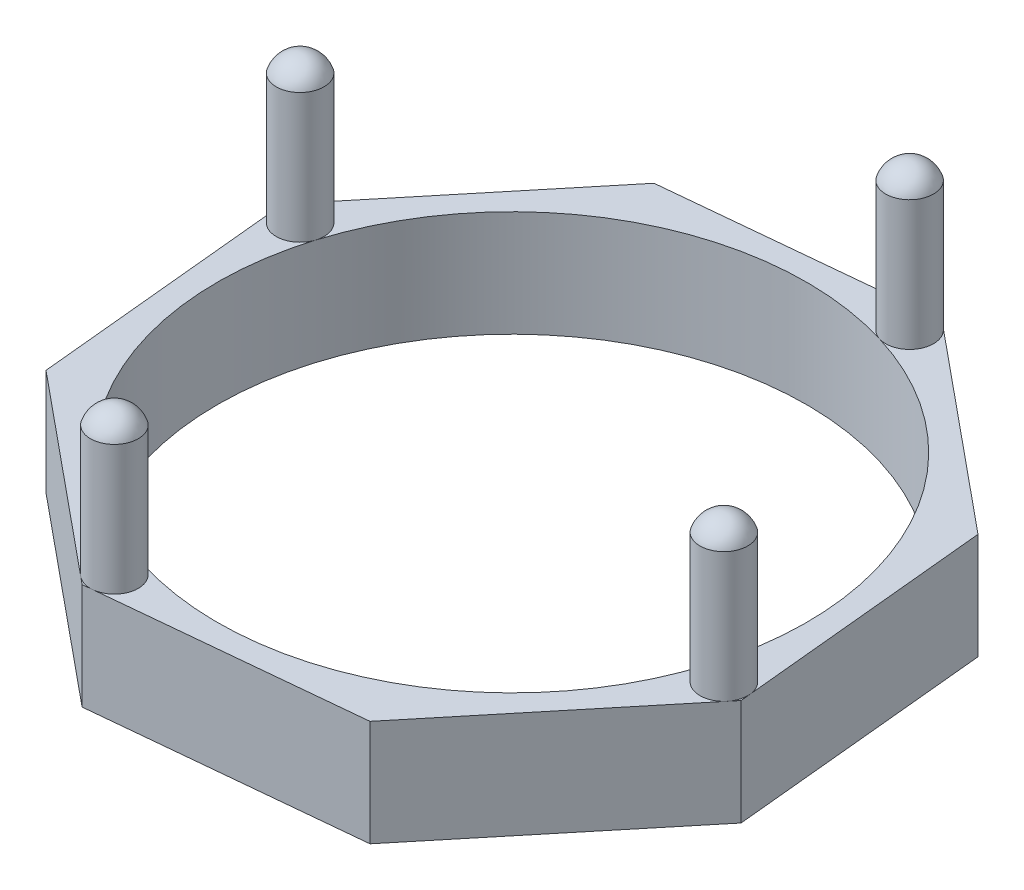
ISO-10303-21;
HEADER;
FILE_DESCRIPTION(('STEP AP214'),'2;1');
FILE_NAME('part.step','',(''),(''),'','','');
FILE_SCHEMA(('AUTOMOTIVE_DESIGN { 1 0 10303 214 1 1 1 1 }'));
ENDSEC;
DATA;
#1=APPLICATION_CONTEXT('core data for automotive mechanical design processes');
#2=APPLICATION_PROTOCOL_DEFINITION('international standard','automotive_design',2000,#1);
#3=PRODUCT_CONTEXT('',#1,'mechanical');
#4=PRODUCT('Part','Part','',(#3));
#5=PRODUCT_RELATED_PRODUCT_CATEGORY('part','',(#4));
#6=PRODUCT_DEFINITION_FORMATION('','',#4);
#7=PRODUCT_DEFINITION_CONTEXT('part definition',#1,'design');
#8=PRODUCT_DEFINITION('design','',#6,#7);
#9=PRODUCT_DEFINITION_SHAPE('','',#8);
#10=(LENGTH_UNIT() NAMED_UNIT(*) SI_UNIT(.MILLI.,.METRE.));
#11=(NAMED_UNIT(*) PLANE_ANGLE_UNIT() SI_UNIT($,.RADIAN.));
#12=(NAMED_UNIT(*) SI_UNIT($,.STERADIAN.) SOLID_ANGLE_UNIT());
#13=UNCERTAINTY_MEASURE_WITH_UNIT(LENGTH_MEASURE(1.E-05),#10,'distance_accuracy_value','');
#14=(GEOMETRIC_REPRESENTATION_CONTEXT(3) GLOBAL_UNCERTAINTY_ASSIGNED_CONTEXT((#13)) GLOBAL_UNIT_ASSIGNED_CONTEXT((#10,
#11,#12)) REPRESENTATION_CONTEXT('',''));
#15=CARTESIAN_POINT('',(0.,0.,0.));
#16=DIRECTION('',(0.,0.,1.));
#17=DIRECTION('',(1.,0.,0.));
#18=AXIS2_PLACEMENT_3D('',#15,#16,#17);
#19=CARTESIAN_POINT('',(0.,18.,0.));
#20=DIRECTION('',(0.,1.,0.));
#21=DIRECTION('',(0.,0.,1.));
#22=AXIS2_PLACEMENT_3D('',#19,#20,#21);
#23=PLANE('',#22);
#24=DIRECTION('',(0.772208636143737,0.,0.635369044150743));
#25=VECTOR('',#24,1.);
#26=CARTESIAN_POINT('',(-51.5823300480479,18.,27.4876286910013));
#27=LINE('',#26,#25);
#28=CARTESIAN_POINT('',(-51.5823300480479,18.,27.4876286910013));
#29=VERTEX_POINT('',#28);
#30=CARTESIAN_POINT('',(-18.3353361997972,18.,54.843073467867));
#31=VERTEX_POINT('',#30);
#32=EDGE_CURVE('E158',#29,#31,#27,.T.);
#33=ORIENTED_EDGE('',*,*,#32,.T.);
#34=CARTESIAN_POINT('',(-15.7573652165715,18.,51.7098842209219));
#35=DIRECTION('',(0.,1.,0.));
#36=DIRECTION('',(0.,0.,1.));
#37=AXIS2_PLACEMENT_3D('',#34,#35,#36);
#38=CIRCLE('',#37,4.05743875462197);
#39=CARTESIAN_POINT('',(-14.5746502050323,18.,47.8286480197885));
#40=VERTEX_POINT('',#39);
#41=EDGE_CURVE('E51',#40,#31,#38,.T.);
#42=ORIENTED_EDGE('',*,*,#41,.F.);
#43=CARTESIAN_POINT('',(0.,18.,0.));
#44=DIRECTION('',(0.,1.,0.));
#45=DIRECTION('',(0.,0.,1.));
#46=AXIS2_PLACEMENT_3D('',#43,#44,#45);
#47=CIRCLE('',#46,50.);
#48=CARTESIAN_POINT('',(-47.8286480197895,18.,-14.5746502050341));
#49=VERTEX_POINT('',#48);
#50=EDGE_CURVE('E182',#49,#40,#47,.T.);
#51=ORIENTED_EDGE('',*,*,#50,.F.);
#52=CARTESIAN_POINT('',(-51.7098842209229,18.,-15.7573652165734));
#53=DIRECTION('',(0.,1.,0.));
#54=DIRECTION('',(0.,0.,1.));
#55=AXIS2_PLACEMENT_3D('',#52,#53,#54);
#56=CIRCLE('',#55,4.05743875462205);
#57=CARTESIAN_POINT('',(-55.7482843481176,18.,-15.364766617259));
#58=VERTEX_POINT('',#57);
#59=EDGE_CURVE('E42',#58,#49,#56,.T.);
#60=ORIENTED_EDGE('',*,*,#59,.F.);
#61=DIRECTION('',(0.0967602034330463,0.,0.995307722783057));
#62=VECTOR('',#61,1.);
#63=CARTESIAN_POINT('',(-55.9109040125223,18.,-17.0375267202323));
#64=LINE('',#63,#62);
#65=EDGE_CURVE('E295',#58,#29,#64,.T.);
#66=ORIENTED_EDGE('',*,*,#65,.T.);
#67=EDGE_LOOP('',(#33,#42,#51,#60,#66));
#68=FACE_BOUND('',#67,.T.);
#69=ADVANCED_FACE('F33',(#68),#23,.T.);
#70=CARTESIAN_POINT('',(47.8286480197902,18.,14.5746502050313));
#71=VERTEX_POINT('',#70);
#72=EDGE_CURVE('E59',#40,#71,#47,.T.);
#73=ORIENTED_EDGE('',*,*,#72,.F.);
#74=CARTESIAN_POINT('',(-15.364766617257,18.,55.7482843481174));
#75=VERTEX_POINT('',#74);
#76=EDGE_CURVE('E138',#75,#40,#38,.T.);
#77=ORIENTED_EDGE('',*,*,#76,.F.);
#78=DIRECTION('',(0.995307722783057,0.,-0.0967602034330467));
#79=VECTOR('',#78,1.);
#80=CARTESIAN_POINT('',(-17.0375267202323,18.,55.9109040125223));
#81=LINE('',#80,#79);
#82=CARTESIAN_POINT('',(27.4876286910014,18.,51.5823300480479));
#83=VERTEX_POINT('',#82);
#84=EDGE_CURVE('E147',#75,#83,#81,.T.);
#85=ORIENTED_EDGE('',*,*,#84,.T.);
#86=DIRECTION('',(0.635369044150743,0.,-0.772208636143737));
#87=VECTOR('',#86,1.);
#88=CARTESIAN_POINT('',(27.4876286910014,18.,51.5823300480479));
#89=LINE('',#88,#87);
#90=CARTESIAN_POINT('',(54.8430734678682,18.,18.3353361997957));
#91=VERTEX_POINT('',#90);
#92=EDGE_CURVE('E164',#83,#91,#89,.T.);
#93=ORIENTED_EDGE('',*,*,#92,.T.);
#94=CARTESIAN_POINT('',(51.7098842209238,18.,15.7573652165705));
#95=DIRECTION('',(0.,1.,0.));
#96=DIRECTION('',(0.,0.,1.));
#97=AXIS2_PLACEMENT_3D('',#94,#95,#96);
#98=CIRCLE('',#97,4.05743875462397);
#99=EDGE_CURVE('E234',#71,#91,#98,.T.);
#100=ORIENTED_EDGE('',*,*,#99,.F.);
#101=EDGE_LOOP('',(#73,#77,#85,#93,#100));
#102=FACE_BOUND('',#101,.T.);
#103=ADVANCED_FACE('F145',(#102),#23,.T.);
#104=CARTESIAN_POINT('',(14.5746502050327,18.,-47.8286480197898));
#105=VERTEX_POINT('',#104);
#106=EDGE_CURVE('E333',#71,#105,#47,.T.);
#107=ORIENTED_EDGE('',*,*,#106,.F.);
#108=CARTESIAN_POINT('',(55.7482843481173,18.,15.3647666172562));
#109=VERTEX_POINT('',#108);
#110=EDGE_CURVE('E232',#109,#71,#98,.T.);
#111=ORIENTED_EDGE('',*,*,#110,.F.);
#112=DIRECTION('',(-0.0967602034330467,0.,-0.995307722783057));
#113=VECTOR('',#112,1.);
#114=CARTESIAN_POINT('',(55.9109040125223,18.,17.0375267202323));
#115=LINE('',#114,#113);
#116=CARTESIAN_POINT('',(51.5823300480479,18.,-27.4876286910014));
#117=VERTEX_POINT('',#116);
#118=EDGE_CURVE('E169',#109,#117,#115,.T.);
#119=ORIENTED_EDGE('',*,*,#118,.T.);
#120=DIRECTION('',(-0.772208636143737,0.,-0.635369044150743));
#121=VECTOR('',#120,1.);
#122=CARTESIAN_POINT('',(51.5823300480479,18.,-27.4876286910014));
#123=LINE('',#122,#121);
#124=CARTESIAN_POINT('',(18.3353361997963,18.,-54.8430734678677));
#125=VERTEX_POINT('',#124);
#126=EDGE_CURVE('E174',#117,#125,#123,.T.);
#127=ORIENTED_EDGE('',*,*,#126,.T.);
#128=CARTESIAN_POINT('',(15.7573652165724,18.,-51.7098842209248));
#129=DIRECTION('',(0.,1.,0.));
#130=DIRECTION('',(0.,0.,1.));
#131=AXIS2_PLACEMENT_3D('',#128,#129,#130);
#132=CIRCLE('',#131,4.05743875462428);
#133=EDGE_CURVE('E226',#105,#125,#132,.T.);
#134=ORIENTED_EDGE('',*,*,#133,.F.);
#135=EDGE_LOOP('',(#107,#111,#119,#127,#134));
#136=FACE_BOUND('',#135,.T.);
#137=ADVANCED_FACE('F258',(#136),#23,.T.);
#138=CARTESIAN_POINT('',(55.9109040125223,18.,17.0375267202323));
#139=VERTEX_POINT('',#138);
#140=EDGE_CURVE('E170',#139,#109,#115,.T.);
#141=ORIENTED_EDGE('',*,*,#140,.T.);
#142=EDGE_CURVE('E227',#91,#109,#98,.T.);
#143=ORIENTED_EDGE('',*,*,#142,.F.);
#144=EDGE_CURVE('E163',#91,#139,#89,.T.);
#145=ORIENTED_EDGE('',*,*,#144,.T.);
#146=EDGE_LOOP('',(#141,#143,#145));
#147=FACE_BOUND('',#146,.T.);
#148=ADVANCED_FACE('F329',(#147),#23,.T.);
#149=EDGE_CURVE('E299',#105,#49,#47,.T.);
#150=ORIENTED_EDGE('',*,*,#149,.F.);
#151=CARTESIAN_POINT('',(15.3647666172582,18.,-55.7482843481175));
#152=VERTEX_POINT('',#151);
#153=EDGE_CURVE('E230',#152,#105,#132,.T.);
#154=ORIENTED_EDGE('',*,*,#153,.F.);
#155=DIRECTION('',(-0.995307722783057,0.,0.0967602034330465));
#156=VECTOR('',#155,1.);
#157=CARTESIAN_POINT('',(17.0375267202323,18.,-55.9109040125223));
#158=LINE('',#157,#156);
#159=CARTESIAN_POINT('',(-27.4876286910014,18.,-51.5823300480479));
#160=VERTEX_POINT('',#159);
#161=EDGE_CURVE('E196',#152,#160,#158,.T.);
#162=ORIENTED_EDGE('',*,*,#161,.T.);
#163=DIRECTION('',(-0.635369044150743,0.,0.772208636143737));
#164=VECTOR('',#163,1.);
#165=CARTESIAN_POINT('',(-27.4876286910014,18.,-51.5823300480479));
#166=LINE('',#165,#164);
#167=CARTESIAN_POINT('',(-54.8430734678664,18.,-18.3353361997979));
#168=VERTEX_POINT('',#167);
#169=EDGE_CURVE('E285',#160,#168,#166,.T.);
#170=ORIENTED_EDGE('',*,*,#169,.T.);
#171=EDGE_CURVE('E44',#49,#168,#56,.T.);
#172=ORIENTED_EDGE('',*,*,#171,.F.);
#173=EDGE_LOOP('',(#150,#154,#162,#170,#172));
#174=FACE_BOUND('',#173,.T.);
#175=ADVANCED_FACE('F292',(#174),#23,.T.);
#176=CARTESIAN_POINT('',(17.0375267202323,18.,-55.9109040125223));
#177=VERTEX_POINT('',#176);
#178=EDGE_CURVE('E287',#177,#152,#158,.T.);
#179=ORIENTED_EDGE('',*,*,#178,.T.);
#180=EDGE_CURVE('E223',#125,#152,#132,.T.);
#181=ORIENTED_EDGE('',*,*,#180,.F.);
#182=EDGE_CURVE('E173',#125,#177,#123,.T.);
#183=ORIENTED_EDGE('',*,*,#182,.T.);
#184=EDGE_LOOP('',(#179,#181,#183));
#185=FACE_BOUND('',#184,.T.);
#186=ADVANCED_FACE('F271',(#185),#23,.T.);
#187=CARTESIAN_POINT('',(-17.0375267202323,18.,55.9109040125223));
#188=VERTEX_POINT('',#187);
#189=EDGE_CURVE('E154',#188,#75,#81,.T.);
#190=ORIENTED_EDGE('',*,*,#189,.T.);
#191=EDGE_CURVE('E135',#31,#75,#38,.T.);
#192=ORIENTED_EDGE('',*,*,#191,.F.);
#193=EDGE_CURVE('E161',#31,#188,#27,.T.);
#194=ORIENTED_EDGE('',*,*,#193,.T.);
#195=EDGE_LOOP('',(#190,#192,#194));
#196=FACE_BOUND('',#195,.T.);
#197=ADVANCED_FACE('F160',(#196),#23,.T.);
#198=EDGE_CURVE('E11',#168,#58,#56,.T.);
#199=ORIENTED_EDGE('',*,*,#198,.F.);
#200=CARTESIAN_POINT('',(-55.9109040125223,18.,-17.0375267202323));
#201=VERTEX_POINT('',#200);
#202=EDGE_CURVE('E274',#168,#201,#166,.T.);
#203=ORIENTED_EDGE('',*,*,#202,.T.);
#204=EDGE_CURVE('E277',#201,#58,#64,.T.);
#205=ORIENTED_EDGE('',*,*,#204,.T.);
#206=EDGE_LOOP('',(#199,#203,#205));
#207=FACE_BOUND('',#206,.T.);
#208=ADVANCED_FACE('F254',(#207),#23,.T.);
#209=CARTESIAN_POINT('',(0.,0.,0.));
#210=DIRECTION('',(0.,1.,0.));
#211=DIRECTION('',(0.,0.,1.));
#212=AXIS2_PLACEMENT_3D('',#209,#210,#211);
#213=PLANE('',#212);
#214=DIRECTION('',(-0.995307722783057,0.,0.0967602034330465));
#215=VECTOR('',#214,1.);
#216=CARTESIAN_POINT('',(17.0375267202323,0.,-55.9109040125223));
#217=LINE('',#216,#215);
#218=CARTESIAN_POINT('',(17.0375267202323,0.,-55.9109040125223));
#219=VERTEX_POINT('',#218);
#220=CARTESIAN_POINT('',(-27.4876286910014,0.,-51.5823300480479));
#221=VERTEX_POINT('',#220);
#222=EDGE_CURVE('E178',#219,#221,#217,.T.);
#223=ORIENTED_EDGE('',*,*,#222,.F.);
#224=DIRECTION('',(-0.772208636143737,0.,-0.635369044150743));
#225=VECTOR('',#224,1.);
#226=CARTESIAN_POINT('',(51.5823300480479,0.,-27.4876286910014));
#227=LINE('',#226,#225);
#228=CARTESIAN_POINT('',(51.5823300480479,0.,-27.4876286910014));
#229=VERTEX_POINT('',#228);
#230=EDGE_CURVE('E194',#229,#219,#227,.T.);
#231=ORIENTED_EDGE('',*,*,#230,.F.);
#232=DIRECTION('',(-0.0967602034330467,0.,-0.995307722783057));
#233=VECTOR('',#232,1.);
#234=CARTESIAN_POINT('',(55.9109040125223,0.,17.0375267202323));
#235=LINE('',#234,#233);
#236=CARTESIAN_POINT('',(55.9109040125223,0.,17.0375267202323));
#237=VERTEX_POINT('',#236);
#238=EDGE_CURVE('E192',#237,#229,#235,.T.);
#239=ORIENTED_EDGE('',*,*,#238,.F.);
#240=DIRECTION('',(0.635369044150743,0.,-0.772208636143737));
#241=VECTOR('',#240,1.);
#242=CARTESIAN_POINT('',(27.4876286910014,0.,51.5823300480479));
#243=LINE('',#242,#241);
#244=CARTESIAN_POINT('',(27.4876286910014,0.,51.5823300480479));
#245=VERTEX_POINT('',#244);
#246=EDGE_CURVE('E190',#245,#237,#243,.T.);
#247=ORIENTED_EDGE('',*,*,#246,.F.);
#248=DIRECTION('',(0.995307722783057,0.,-0.0967602034330467));
#249=VECTOR('',#248,1.);
#250=CARTESIAN_POINT('',(-17.0375267202323,0.,55.9109040125223));
#251=LINE('',#250,#249);
#252=CARTESIAN_POINT('',(-17.0375267202323,0.,55.9109040125223));
#253=VERTEX_POINT('',#252);
#254=EDGE_CURVE('E188',#253,#245,#251,.T.);
#255=ORIENTED_EDGE('',*,*,#254,.F.);
#256=DIRECTION('',(0.772208636143737,0.,0.635369044150743));
#257=VECTOR('',#256,1.);
#258=CARTESIAN_POINT('',(-51.5823300480479,0.,27.4876286910013));
#259=LINE('',#258,#257);
#260=CARTESIAN_POINT('',(-51.5823300480479,0.,27.4876286910013));
#261=VERTEX_POINT('',#260);
#262=EDGE_CURVE('E186',#261,#253,#259,.T.);
#263=ORIENTED_EDGE('',*,*,#262,.F.);
#264=DIRECTION('',(0.0967602034330463,0.,0.995307722783057));
#265=VECTOR('',#264,1.);
#266=CARTESIAN_POINT('',(-55.9109040125223,0.,-17.0375267202323));
#267=LINE('',#266,#265);
#268=CARTESIAN_POINT('',(-55.9109040125223,0.,-17.0375267202323));
#269=VERTEX_POINT('',#268);
#270=EDGE_CURVE('E184',#269,#261,#267,.T.);
#271=ORIENTED_EDGE('',*,*,#270,.F.);
#272=DIRECTION('',(-0.635369044150743,0.,0.772208636143737));
#273=VECTOR('',#272,1.);
#274=CARTESIAN_POINT('',(-27.4876286910014,0.,-51.5823300480479));
#275=LINE('',#274,#273);
#276=EDGE_CURVE('E181',#221,#269,#275,.T.);
#277=ORIENTED_EDGE('',*,*,#276,.F.);
#278=EDGE_LOOP('',(#223,#231,#239,#247,#255,#263,#271,#277));
#279=FACE_BOUND('',#278,.T.);
#280=CARTESIAN_POINT('',(0.,0.,0.));
#281=DIRECTION('',(0.,1.,0.));
#282=DIRECTION('',(0.,0.,1.));
#283=AXIS2_PLACEMENT_3D('',#280,#281,#282);
#284=CIRCLE('',#283,50.);
#285=CARTESIAN_POINT('',(0.,0.,50.));
#286=VERTEX_POINT('',#285);
#287=EDGE_CURVE('E220',#286,#286,#284,.T.);
#288=ORIENTED_EDGE('',*,*,#287,.T.);
#289=EDGE_LOOP('',(#288));
#290=FACE_BOUND('',#289,.T.);
#291=ADVANCED_FACE('F263',(#279,#290),#213,.F.);
#292=CARTESIAN_POINT('',(17.0375267202323,18.,-55.9109040125223));
#293=DIRECTION('',(0.0967602034330465,0.,0.995307722783057));
#294=DIRECTION('',(0.995307722783058,0.,-0.0967602034330465));
#295=AXIS2_PLACEMENT_3D('',#292,#293,#294);
#296=PLANE('',#295);
#297=ORIENTED_EDGE('',*,*,#222,.T.);
#298=DIRECTION('',(0.,-1.,0.));
#299=VECTOR('',#298,1.);
#300=CARTESIAN_POINT('',(-27.4876286910014,18.,-51.5823300480479));
#301=LINE('',#300,#299);
#302=EDGE_CURVE('E214',#160,#221,#301,.T.);
#303=ORIENTED_EDGE('',*,*,#302,.F.);
#304=ORIENTED_EDGE('',*,*,#161,.F.);
#305=ORIENTED_EDGE('',*,*,#178,.F.);
#306=DIRECTION('',(0.,-1.,0.));
#307=VECTOR('',#306,1.);
#308=CARTESIAN_POINT('',(17.0375267202323,18.,-55.9109040125223));
#309=LINE('',#308,#307);
#310=EDGE_CURVE('E177',#177,#219,#309,.T.);
#311=ORIENTED_EDGE('',*,*,#310,.T.);
#312=EDGE_LOOP('',(#297,#303,#304,#305,#311));
#313=FACE_BOUND('',#312,.T.);
#314=ADVANCED_FACE('F269',(#313),#296,.F.);
#315=CARTESIAN_POINT('',(-27.4876286910014,18.,-51.5823300480479));
#316=DIRECTION('',(0.772208636143737,0.,0.635369044150743));
#317=DIRECTION('',(0.635369044150743,0.,-0.772208636143737));
#318=AXIS2_PLACEMENT_3D('',#315,#316,#317);
#319=PLANE('',#318);
#320=ORIENTED_EDGE('',*,*,#276,.T.);
#321=DIRECTION('',(0.,-1.,0.));
#322=VECTOR('',#321,1.);
#323=CARTESIAN_POINT('',(-55.9109040125223,18.,-17.0375267202323));
#324=LINE('',#323,#322);
#325=EDGE_CURVE('E211',#201,#269,#324,.T.);
#326=ORIENTED_EDGE('',*,*,#325,.F.);
#327=ORIENTED_EDGE('',*,*,#202,.F.);
#328=ORIENTED_EDGE('',*,*,#169,.F.);
#329=ORIENTED_EDGE('',*,*,#302,.T.);
#330=EDGE_LOOP('',(#320,#326,#327,#328,#329));
#331=FACE_BOUND('',#330,.T.);
#332=ADVANCED_FACE('F284',(#331),#319,.F.);
#333=CARTESIAN_POINT('',(-55.9109040125223,18.,-17.0375267202323));
#334=DIRECTION('',(0.995307722783057,0.,-0.0967602034330463));
#335=DIRECTION('',(-0.0967602034330463,0.,-0.995307722783058));
#336=AXIS2_PLACEMENT_3D('',#333,#334,#335);
#337=PLANE('',#336);
#338=ORIENTED_EDGE('',*,*,#270,.T.);
#339=DIRECTION('',(0.,-1.,0.));
#340=VECTOR('',#339,1.);
#341=CARTESIAN_POINT('',(-51.5823300480479,18.,27.4876286910013));
#342=LINE('',#341,#340);
#343=EDGE_CURVE('E208',#29,#261,#342,.T.);
#344=ORIENTED_EDGE('',*,*,#343,.F.);
#345=ORIENTED_EDGE('',*,*,#65,.F.);
#346=ORIENTED_EDGE('',*,*,#204,.F.);
#347=ORIENTED_EDGE('',*,*,#325,.T.);
#348=EDGE_LOOP('',(#338,#344,#345,#346,#347));
#349=FACE_BOUND('',#348,.T.);
#350=ADVANCED_FACE('F308',(#349),#337,.F.);
#351=CARTESIAN_POINT('',(-51.5823300480479,18.,27.4876286910013));
#352=DIRECTION('',(0.635369044150743,0.,-0.772208636143737));
#353=DIRECTION('',(-0.772208636143737,0.,-0.635369044150743));
#354=AXIS2_PLACEMENT_3D('',#351,#352,#353);
#355=PLANE('',#354);
#356=ORIENTED_EDGE('',*,*,#262,.T.);
#357=DIRECTION('',(0.,-1.,0.));
#358=VECTOR('',#357,1.);
#359=CARTESIAN_POINT('',(-17.0375267202323,18.,55.9109040125223));
#360=LINE('',#359,#358);
#361=EDGE_CURVE('E206',#188,#253,#360,.T.);
#362=ORIENTED_EDGE('',*,*,#361,.F.);
#363=ORIENTED_EDGE('',*,*,#193,.F.);
#364=ORIENTED_EDGE('',*,*,#32,.F.);
#365=ORIENTED_EDGE('',*,*,#343,.T.);
#366=EDGE_LOOP('',(#356,#362,#363,#364,#365));
#367=FACE_BOUND('',#366,.T.);
#368=ADVANCED_FACE('F312',(#367),#355,.F.);
#369=CARTESIAN_POINT('',(-17.0375267202323,18.,55.9109040125223));
#370=DIRECTION('',(-0.0967602034330466,0.,-0.995307722783057));
#371=DIRECTION('',(-0.995307722783058,0.,0.0967602034330467));
#372=AXIS2_PLACEMENT_3D('',#369,#370,#371);
#373=PLANE('',#372);
#374=ORIENTED_EDGE('',*,*,#254,.T.);
#375=DIRECTION('',(0.,-1.,0.));
#376=VECTOR('',#375,1.);
#377=CARTESIAN_POINT('',(27.4876286910014,18.,51.5823300480479));
#378=LINE('',#377,#376);
#379=EDGE_CURVE('E156',#83,#245,#378,.T.);
#380=ORIENTED_EDGE('',*,*,#379,.F.);
#381=ORIENTED_EDGE('',*,*,#84,.F.);
#382=ORIENTED_EDGE('',*,*,#189,.F.);
#383=ORIENTED_EDGE('',*,*,#361,.T.);
#384=EDGE_LOOP('',(#374,#380,#381,#382,#383));
#385=FACE_BOUND('',#384,.T.);
#386=ADVANCED_FACE('F152',(#385),#373,.F.);
#387=CARTESIAN_POINT('',(27.4876286910014,18.,51.5823300480479));
#388=DIRECTION('',(-0.772208636143737,0.,-0.635369044150743));
#389=DIRECTION('',(-0.635369044150743,0.,0.772208636143737));
#390=AXIS2_PLACEMENT_3D('',#387,#388,#389);
#391=PLANE('',#390);
#392=ORIENTED_EDGE('',*,*,#246,.T.);
#393=DIRECTION('',(0.,-1.,0.));
#394=VECTOR('',#393,1.);
#395=CARTESIAN_POINT('',(55.9109040125223,18.,17.0375267202323));
#396=LINE('',#395,#394);
#397=EDGE_CURVE('E202',#139,#237,#396,.T.);
#398=ORIENTED_EDGE('',*,*,#397,.F.);
#399=ORIENTED_EDGE('',*,*,#144,.F.);
#400=ORIENTED_EDGE('',*,*,#92,.F.);
#401=ORIENTED_EDGE('',*,*,#379,.T.);
#402=EDGE_LOOP('',(#392,#398,#399,#400,#401));
#403=FACE_BOUND('',#402,.T.);
#404=ADVANCED_FACE('F321',(#403),#391,.F.);
#405=CARTESIAN_POINT('',(55.9109040125223,18.,17.0375267202323));
#406=DIRECTION('',(-0.995307722783057,0.,0.0967602034330468));
#407=DIRECTION('',(0.0967602034330468,0.,0.995307722783057));
#408=AXIS2_PLACEMENT_3D('',#405,#406,#407);
#409=PLANE('',#408);
#410=ORIENTED_EDGE('',*,*,#238,.T.);
#411=DIRECTION('',(0.,-1.,0.));
#412=VECTOR('',#411,1.);
#413=CARTESIAN_POINT('',(51.5823300480479,18.,-27.4876286910014));
#414=LINE('',#413,#412);
#415=EDGE_CURVE('E199',#117,#229,#414,.T.);
#416=ORIENTED_EDGE('',*,*,#415,.F.);
#417=ORIENTED_EDGE('',*,*,#118,.F.);
#418=ORIENTED_EDGE('',*,*,#140,.F.);
#419=ORIENTED_EDGE('',*,*,#397,.T.);
#420=EDGE_LOOP('',(#410,#416,#417,#418,#419));
#421=FACE_BOUND('',#420,.T.);
#422=ADVANCED_FACE('F325',(#421),#409,.F.);
#423=CARTESIAN_POINT('',(51.5823300480479,18.,-27.4876286910014));
#424=DIRECTION('',(-0.635369044150743,0.,0.772208636143737));
#425=DIRECTION('',(0.772208636143737,0.,0.635369044150743));
#426=AXIS2_PLACEMENT_3D('',#423,#424,#425);
#427=PLANE('',#426);
#428=ORIENTED_EDGE('',*,*,#230,.T.);
#429=ORIENTED_EDGE('',*,*,#310,.F.);
#430=ORIENTED_EDGE('',*,*,#182,.F.);
#431=ORIENTED_EDGE('',*,*,#126,.F.);
#432=ORIENTED_EDGE('',*,*,#415,.T.);
#433=EDGE_LOOP('',(#428,#429,#430,#431,#432));
#434=FACE_BOUND('',#433,.T.);
#435=ADVANCED_FACE('F346',(#434),#427,.F.);
#436=CARTESIAN_POINT('',(0.,18.,0.));
#437=DIRECTION('',(0.,-1.,0.));
#438=DIRECTION('',(0.,0.,-1.));
#439=AXIS2_PLACEMENT_3D('',#436,#437,#438);
#440=CYLINDRICAL_SURFACE('',#439,50.);
#441=ORIENTED_EDGE('',*,*,#50,.T.);
#442=ORIENTED_EDGE('',*,*,#72,.T.);
#443=ORIENTED_EDGE('',*,*,#106,.T.);
#444=ORIENTED_EDGE('',*,*,#149,.T.);
#445=EDGE_LOOP('',(#441,#442,#443,#444));
#446=FACE_BOUND('',#445,.T.);
#447=ORIENTED_EDGE('',*,*,#287,.F.);
#448=EDGE_LOOP('',(#447));
#449=FACE_BOUND('',#448,.T.);
#450=ADVANCED_FACE('F335',(#446,#449),#440,.F.);
#451=CARTESIAN_POINT('',(-51.7098842209229,40.,-15.7573652165734));
#452=DIRECTION('',(0.,-1.,0.));
#453=DIRECTION('',(0.,0.,-1.));
#454=AXIS2_PLACEMENT_3D('',#451,#452,#453);
#455=CYLINDRICAL_SURFACE('',#454,4.05743875462205);
#456=CARTESIAN_POINT('',(-51.7098842209229,40.,-15.7573652165734));
#457=DIRECTION('',(0.,1.,0.));
#458=DIRECTION('',(0.,0.,1.));
#459=AXIS2_PLACEMENT_3D('',#456,#457,#458);
#460=CIRCLE('',#459,4.05743875462205);
#461=CARTESIAN_POINT('',(-51.7098842209229,40.,-11.6999264619513));
#462=VERTEX_POINT('',#461);
#463=EDGE_CURVE('E217',#462,#462,#460,.T.);
#464=ORIENTED_EDGE('',*,*,#463,.F.);
#465=EDGE_LOOP('',(#464));
#466=FACE_BOUND('',#465,.T.);
#467=ORIENTED_EDGE('',*,*,#171,.T.);
#468=ORIENTED_EDGE('',*,*,#198,.T.);
#469=ORIENTED_EDGE('',*,*,#59,.T.);
#470=EDGE_LOOP('',(#467,#468,#469));
#471=FACE_BOUND('',#470,.T.);
#472=ADVANCED_FACE('F296',(#466,#471),#455,.T.);
#473=CARTESIAN_POINT('',(-51.7098842209229,38.7561984587485,-15.7573652165734));
#474=DIRECTION('',(0.,0.,1.));
#475=DIRECTION('',(1.,0.,0.));
#476=AXIS2_PLACEMENT_3D('',#473,#474,#475);
#477=SPHERICAL_SURFACE('',#476,4.24380154125149);
#478=CARTESIAN_POINT('',(-51.7098842209229,38.7561984587485,-15.7573652165734));
#479=DIRECTION('',(0.,1.,0.));
#480=DIRECTION('',(0.,0.,1.));
#481=AXIS2_PLACEMENT_3D('',#478,#479,#480);
#482=SPHERICAL_SURFACE('',#481,4.24380154125149);
#483=ORIENTED_EDGE('',*,*,#463,.T.);
#484=EDGE_LOOP('',(#483));
#485=FACE_BOUND('',#484,.T.);
#486=ADVANCED_FACE('F367',(#485),#482,.T.);
#487=CARTESIAN_POINT('',(15.7573652165724,40.,-51.7098842209248));
#488=DIRECTION('',(0.,-1.,0.));
#489=DIRECTION('',(0.,0.,-1.));
#490=AXIS2_PLACEMENT_3D('',#487,#488,#489);
#491=CYLINDRICAL_SURFACE('',#490,4.05743875462428);
#492=CARTESIAN_POINT('',(15.7573652165724,40.,-51.7098842209248));
#493=DIRECTION('',(0.,1.,0.));
#494=DIRECTION('',(0.,0.,1.));
#495=AXIS2_PLACEMENT_3D('',#492,#493,#494);
#496=CIRCLE('',#495,4.05743875462428);
#497=CARTESIAN_POINT('',(15.7573652165724,40.,-47.6524454663005));
#498=VERTEX_POINT('',#497);
#499=EDGE_CURVE('E221',#498,#498,#496,.T.);
#500=ORIENTED_EDGE('',*,*,#499,.F.);
#501=EDGE_LOOP('',(#500));
#502=FACE_BOUND('',#501,.T.);
#503=ORIENTED_EDGE('',*,*,#180,.T.);
#504=ORIENTED_EDGE('',*,*,#153,.T.);
#505=ORIENTED_EDGE('',*,*,#133,.T.);
#506=EDGE_LOOP('',(#503,#504,#505));
#507=FACE_BOUND('',#506,.T.);
#508=ADVANCED_FACE('F370',(#502,#507),#491,.T.);
#509=CARTESIAN_POINT('',(15.7573652165724,38.7561984587455,-51.7098842209248));
#510=DIRECTION('',(0.,0.,1.));
#511=DIRECTION('',(1.,0.,0.));
#512=AXIS2_PLACEMENT_3D('',#509,#510,#511);
#513=SPHERICAL_SURFACE('',#512,4.24380154125451);
#514=CARTESIAN_POINT('',(15.7573652165724,38.7561984587455,-51.7098842209248));
#515=DIRECTION('',(0.,1.,0.));
#516=DIRECTION('',(0.,0.,1.));
#517=AXIS2_PLACEMENT_3D('',#514,#515,#516);
#518=SPHERICAL_SURFACE('',#517,4.24380154125451);
#519=ORIENTED_EDGE('',*,*,#499,.T.);
#520=EDGE_LOOP('',(#519));
#521=FACE_BOUND('',#520,.T.);
#522=ADVANCED_FACE('F372',(#521),#518,.T.);
#523=CARTESIAN_POINT('',(51.7098842209238,40.,15.7573652165705));
#524=DIRECTION('',(0.,-1.,0.));
#525=DIRECTION('',(0.,0.,-1.));
#526=AXIS2_PLACEMENT_3D('',#523,#524,#525);
#527=CYLINDRICAL_SURFACE('',#526,4.05743875462397);
#528=CARTESIAN_POINT('',(51.7098842209238,40.,15.7573652165705));
#529=DIRECTION('',(0.,1.,0.));
#530=DIRECTION('',(0.,0.,1.));
#531=AXIS2_PLACEMENT_3D('',#528,#529,#530);
#532=CIRCLE('',#531,4.05743875462397);
#533=CARTESIAN_POINT('',(51.7098842209238,40.,19.8148039711944));
#534=VERTEX_POINT('',#533);
#535=EDGE_CURVE('E224',#534,#534,#532,.T.);
#536=ORIENTED_EDGE('',*,*,#535,.F.);
#537=EDGE_LOOP('',(#536));
#538=FACE_BOUND('',#537,.T.);
#539=ORIENTED_EDGE('',*,*,#142,.T.);
#540=ORIENTED_EDGE('',*,*,#110,.T.);
#541=ORIENTED_EDGE('',*,*,#99,.T.);
#542=EDGE_LOOP('',(#539,#540,#541));
#543=FACE_BOUND('',#542,.T.);
#544=ADVANCED_FACE('F249',(#538,#543),#527,.T.);
#545=CARTESIAN_POINT('',(51.7098842209238,38.7561984587459,15.7573652165705));
#546=DIRECTION('',(0.,0.,1.));
#547=DIRECTION('',(1.,0.,0.));
#548=AXIS2_PLACEMENT_3D('',#545,#546,#547);
#549=SPHERICAL_SURFACE('',#548,4.24380154125409);
#550=CARTESIAN_POINT('',(51.7098842209238,38.7561984587459,15.7573652165705));
#551=DIRECTION('',(0.,1.,0.));
#552=DIRECTION('',(0.,0.,1.));
#553=AXIS2_PLACEMENT_3D('',#550,#551,#552);
#554=SPHERICAL_SURFACE('',#553,4.24380154125409);
#555=ORIENTED_EDGE('',*,*,#535,.T.);
#556=EDGE_LOOP('',(#555));
#557=FACE_BOUND('',#556,.T.);
#558=ADVANCED_FACE('F243',(#557),#554,.T.);
#559=CARTESIAN_POINT('',(-15.7573652165715,40.,51.7098842209219));
#560=DIRECTION('',(0.,-1.,0.));
#561=DIRECTION('',(0.,0.,-1.));
#562=AXIS2_PLACEMENT_3D('',#559,#560,#561);
#563=CYLINDRICAL_SURFACE('',#562,4.05743875462197);
#564=CARTESIAN_POINT('',(-15.7573652165715,40.,51.7098842209219));
#565=DIRECTION('',(0.,1.,0.));
#566=DIRECTION('',(0.,0.,1.));
#567=AXIS2_PLACEMENT_3D('',#564,#565,#566);
#568=CIRCLE('',#567,4.05743875462197);
#569=CARTESIAN_POINT('',(-15.7573652165715,40.,55.7673229755439));
#570=VERTEX_POINT('',#569);
#571=EDGE_CURVE('E37',#570,#570,#568,.T.);
#572=ORIENTED_EDGE('',*,*,#571,.F.);
#573=EDGE_LOOP('',(#572));
#574=FACE_BOUND('',#573,.T.);
#575=ORIENTED_EDGE('',*,*,#76,.T.);
#576=ORIENTED_EDGE('',*,*,#41,.T.);
#577=ORIENTED_EDGE('',*,*,#191,.T.);
#578=EDGE_LOOP('',(#575,#576,#577));
#579=FACE_BOUND('',#578,.T.);
#580=ADVANCED_FACE('F137',(#574,#579),#563,.T.);
#581=CARTESIAN_POINT('',(-15.7573652165715,38.7561984587486,51.7098842209219));
#582=DIRECTION('',(0.,0.,1.));
#583=DIRECTION('',(1.,0.,0.));
#584=AXIS2_PLACEMENT_3D('',#581,#582,#583);
#585=SPHERICAL_SURFACE('',#584,4.24380154125138);
#586=CARTESIAN_POINT('',(-15.7573652165715,38.7561984587486,51.7098842209219));
#587=DIRECTION('',(0.,1.,0.));
#588=DIRECTION('',(0.,0.,1.));
#589=AXIS2_PLACEMENT_3D('',#586,#587,#588);
#590=SPHERICAL_SURFACE('',#589,4.24380154125138);
#591=ORIENTED_EDGE('',*,*,#571,.T.);
#592=EDGE_LOOP('',(#591));
#593=FACE_BOUND('',#592,.T.);
#594=ADVANCED_FACE('F35',(#593),#590,.T.);
#595=CLOSED_SHELL('',(#69,#103,#137,#148,#175,#186,#197,#208,#291,#314,#332,#350,#368,#386,#404,
#422,#435,#450,#472,#486,#508,#522,#544,#558,#580,#594));
#596=MANIFOLD_SOLID_BREP('B2',#595);
#597=ADVANCED_BREP_SHAPE_REPRESENTATION('',(#18,#596),#14);
#598=SHAPE_DEFINITION_REPRESENTATION(#9,#597);
ENDSEC;
END-ISO-10303-21;
